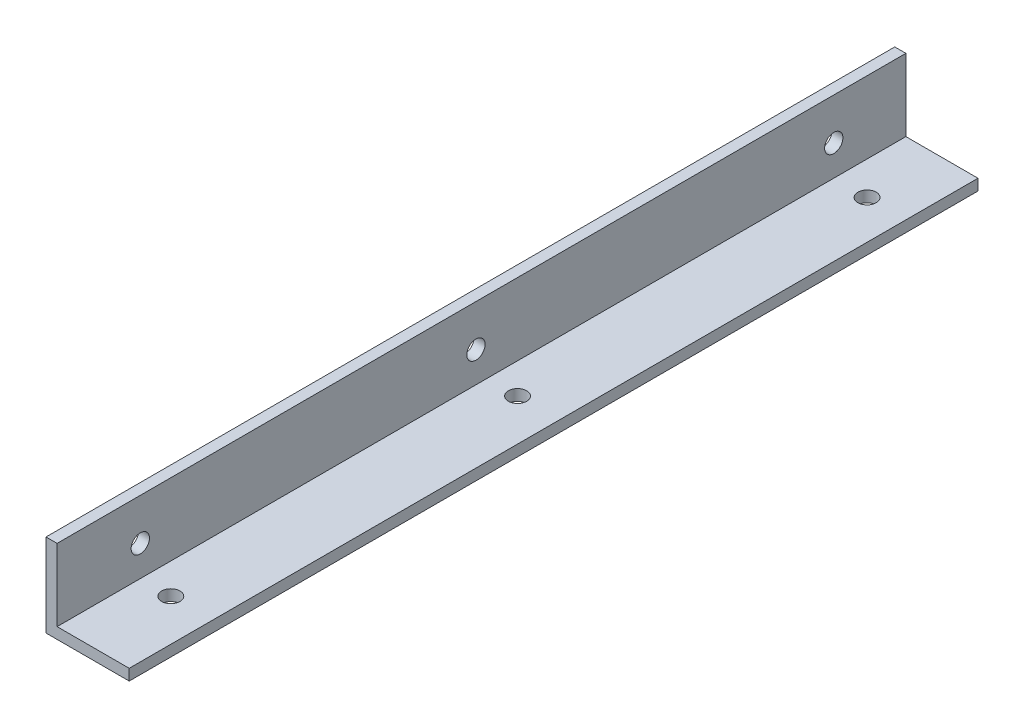
ISO-10303-21;
HEADER;
FILE_DESCRIPTION(('STEP AP214'),'2;1');
FILE_NAME('part.step','',(''),(''),'','','');
FILE_SCHEMA(('AUTOMOTIVE_DESIGN { 1 0 10303 214 1 1 1 1 }'));
ENDSEC;
DATA;
#1=APPLICATION_CONTEXT('core data for automotive mechanical design processes');
#2=APPLICATION_PROTOCOL_DEFINITION('international standard','automotive_design',2000,#1);
#3=PRODUCT_CONTEXT('',#1,'mechanical');
#4=PRODUCT('Part','Part','',(#3));
#5=PRODUCT_RELATED_PRODUCT_CATEGORY('part','',(#4));
#6=PRODUCT_DEFINITION_FORMATION('','',#4);
#7=PRODUCT_DEFINITION_CONTEXT('part definition',#1,'design');
#8=PRODUCT_DEFINITION('design','',#6,#7);
#9=PRODUCT_DEFINITION_SHAPE('','',#8);
#10=(LENGTH_UNIT() NAMED_UNIT(*) SI_UNIT(.MILLI.,.METRE.));
#11=(NAMED_UNIT(*) PLANE_ANGLE_UNIT() SI_UNIT($,.RADIAN.));
#12=(NAMED_UNIT(*) SI_UNIT($,.STERADIAN.) SOLID_ANGLE_UNIT());
#13=UNCERTAINTY_MEASURE_WITH_UNIT(LENGTH_MEASURE(1.E-05),#10,'distance_accuracy_value','');
#14=(GEOMETRIC_REPRESENTATION_CONTEXT(3) GLOBAL_UNCERTAINTY_ASSIGNED_CONTEXT((#13)) GLOBAL_UNIT_ASSIGNED_CONTEXT((#10,
#11,#12)) REPRESENTATION_CONTEXT('',''));
#15=CARTESIAN_POINT('',(0.,0.,0.));
#16=DIRECTION('',(0.,0.,1.));
#17=DIRECTION('',(1.,0.,0.));
#18=AXIS2_PLACEMENT_3D('',#15,#16,#17);
#19=CARTESIAN_POINT('',(15.,0.,155.));
#20=DIRECTION('',(0.,1.,0.));
#21=DIRECTION('',(-1.,0.,0.));
#22=AXIS2_PLACEMENT_3D('',#19,#20,#21);
#23=PLANE('',#22);
#24=CARTESIAN_POINT('',(7.5,0.,140.));
#25=DIRECTION('',(0.,1.,0.));
#26=DIRECTION('',(-1.,0.,0.));
#27=AXIS2_PLACEMENT_3D('',#24,#25,#26);
#28=CIRCLE('',#27,1.64999999999999);
#29=CARTESIAN_POINT('',(5.85000000000001,0.,140.));
#30=VERTEX_POINT('',#29);
#31=EDGE_CURVE('E138',#30,#30,#28,.T.);
#32=ORIENTED_EDGE('',*,*,#31,.T.);
#33=EDGE_LOOP('',(#32));
#34=FACE_BOUND('',#33,.T.);
#35=CARTESIAN_POINT('',(7.5,0.,77.5));
#36=DIRECTION('',(0.,1.,0.));
#37=DIRECTION('',(-1.,0.,0.));
#38=AXIS2_PLACEMENT_3D('',#35,#36,#37);
#39=CIRCLE('',#38,1.64999999999999);
#40=CARTESIAN_POINT('',(5.85000000000001,0.,77.5));
#41=VERTEX_POINT('',#40);
#42=EDGE_CURVE('E144',#41,#41,#39,.T.);
#43=ORIENTED_EDGE('',*,*,#42,.T.);
#44=EDGE_LOOP('',(#43));
#45=FACE_BOUND('',#44,.T.);
#46=CARTESIAN_POINT('',(8.,0.,15.));
#47=DIRECTION('',(0.,1.,0.));
#48=DIRECTION('',(-1.,0.,0.));
#49=AXIS2_PLACEMENT_3D('',#46,#47,#48);
#50=CIRCLE('',#49,1.64999999999999);
#51=CARTESIAN_POINT('',(6.35000000000001,0.,15.));
#52=VERTEX_POINT('',#51);
#53=EDGE_CURVE('E156',#52,#52,#50,.T.);
#54=ORIENTED_EDGE('',*,*,#53,.T.);
#55=EDGE_LOOP('',(#54));
#56=FACE_BOUND('',#55,.T.);
#57=DIRECTION('',(0.,0.,-1.));
#58=VECTOR('',#57,1.);
#59=CARTESIAN_POINT('',(0.,0.,155.));
#60=LINE('',#59,#58);
#61=CARTESIAN_POINT('',(0.,0.,155.));
#62=VERTEX_POINT('',#61);
#63=CARTESIAN_POINT('',(0.,0.,2.));
#64=VERTEX_POINT('',#63);
#65=EDGE_CURVE('E102',#62,#64,#60,.T.);
#66=ORIENTED_EDGE('',*,*,#65,.T.);
#67=DIRECTION('',(1.,0.,0.));
#68=VECTOR('',#67,1.);
#69=CARTESIAN_POINT('',(15.,0.,2.));
#70=LINE('',#69,#68);
#71=CARTESIAN_POINT('',(15.,0.,2.));
#72=VERTEX_POINT('',#71);
#73=EDGE_CURVE('E49',#64,#72,#70,.T.);
#74=ORIENTED_EDGE('',*,*,#73,.T.);
#75=DIRECTION('',(0.,0.,-1.));
#76=VECTOR('',#75,1.);
#77=CARTESIAN_POINT('',(15.,0.,155.));
#78=LINE('',#77,#76);
#79=CARTESIAN_POINT('',(15.,0.,155.));
#80=VERTEX_POINT('',#79);
#81=EDGE_CURVE('E42',#80,#72,#78,.T.);
#82=ORIENTED_EDGE('',*,*,#81,.F.);
#83=DIRECTION('',(1.,0.,0.));
#84=VECTOR('',#83,1.);
#85=CARTESIAN_POINT('',(15.,0.,155.));
#86=LINE('',#85,#84);
#87=EDGE_CURVE('E123',#62,#80,#86,.T.);
#88=ORIENTED_EDGE('',*,*,#87,.F.);
#89=EDGE_LOOP('',(#66,#74,#82,#88));
#90=FACE_BOUND('',#89,.T.);
#91=ADVANCED_FACE('F35',(#34,#45,#56,#90),#23,.F.);
#92=CARTESIAN_POINT('',(15.,2.,155.));
#93=DIRECTION('',(-1.,0.,0.));
#94=DIRECTION('',(0.,0.,1.));
#95=AXIS2_PLACEMENT_3D('',#92,#93,#94);
#96=PLANE('',#95);
#97=ORIENTED_EDGE('',*,*,#81,.T.);
#98=DIRECTION('',(0.,1.,0.));
#99=VECTOR('',#98,1.);
#100=CARTESIAN_POINT('',(15.,2.,2.));
#101=LINE('',#100,#99);
#102=CARTESIAN_POINT('',(15.,2.,2.));
#103=VERTEX_POINT('',#102);
#104=EDGE_CURVE('E119',#72,#103,#101,.T.);
#105=ORIENTED_EDGE('',*,*,#104,.T.);
#106=DIRECTION('',(0.,0.,-1.));
#107=VECTOR('',#106,1.);
#108=CARTESIAN_POINT('',(15.,2.,155.));
#109=LINE('',#108,#107);
#110=CARTESIAN_POINT('',(15.,2.,155.));
#111=VERTEX_POINT('',#110);
#112=EDGE_CURVE('E111',#111,#103,#109,.T.);
#113=ORIENTED_EDGE('',*,*,#112,.F.);
#114=DIRECTION('',(0.,1.,0.));
#115=VECTOR('',#114,1.);
#116=CARTESIAN_POINT('',(15.,2.,155.));
#117=LINE('',#116,#115);
#118=EDGE_CURVE('E120',#80,#111,#117,.T.);
#119=ORIENTED_EDGE('',*,*,#118,.F.);
#120=EDGE_LOOP('',(#97,#105,#113,#119));
#121=FACE_BOUND('',#120,.T.);
#122=ADVANCED_FACE('F117',(#121),#96,.F.);
#123=CARTESIAN_POINT('',(2.,2.,155.));
#124=DIRECTION('',(0.,-1.,0.));
#125=DIRECTION('',(0.,0.,-1.));
#126=AXIS2_PLACEMENT_3D('',#123,#124,#125);
#127=PLANE('',#126);
#128=CARTESIAN_POINT('',(7.5,2.,140.));
#129=DIRECTION('',(0.,1.,0.));
#130=DIRECTION('',(0.,0.,1.));
#131=AXIS2_PLACEMENT_3D('',#128,#129,#130);
#132=CIRCLE('',#131,1.64999999999999);
#133=CARTESIAN_POINT('',(7.5,2.,141.65));
#134=VERTEX_POINT('',#133);
#135=EDGE_CURVE('E135',#134,#134,#132,.T.);
#136=ORIENTED_EDGE('',*,*,#135,.F.);
#137=EDGE_LOOP('',(#136));
#138=FACE_BOUND('',#137,.T.);
#139=CARTESIAN_POINT('',(7.5,2.,77.5));
#140=DIRECTION('',(0.,1.,0.));
#141=DIRECTION('',(0.,0.,1.));
#142=AXIS2_PLACEMENT_3D('',#139,#140,#141);
#143=CIRCLE('',#142,1.64999999999999);
#144=CARTESIAN_POINT('',(7.5,2.,79.15));
#145=VERTEX_POINT('',#144);
#146=EDGE_CURVE('E141',#145,#145,#143,.T.);
#147=ORIENTED_EDGE('',*,*,#146,.F.);
#148=EDGE_LOOP('',(#147));
#149=FACE_BOUND('',#148,.T.);
#150=CARTESIAN_POINT('',(8.,2.,15.));
#151=DIRECTION('',(0.,1.,0.));
#152=DIRECTION('',(0.,0.,1.));
#153=AXIS2_PLACEMENT_3D('',#150,#151,#152);
#154=CIRCLE('',#153,1.64999999999999);
#155=CARTESIAN_POINT('',(8.,2.,16.65));
#156=VERTEX_POINT('',#155);
#157=EDGE_CURVE('E153',#156,#156,#154,.T.);
#158=ORIENTED_EDGE('',*,*,#157,.F.);
#159=EDGE_LOOP('',(#158));
#160=FACE_BOUND('',#159,.T.);
#161=ORIENTED_EDGE('',*,*,#112,.T.);
#162=DIRECTION('',(-1.,0.,0.));
#163=VECTOR('',#162,1.);
#164=CARTESIAN_POINT('',(2.,2.,2.));
#165=LINE('',#164,#163);
#166=CARTESIAN_POINT('',(2.,2.,2.));
#167=VERTEX_POINT('',#166);
#168=EDGE_CURVE('E129',#103,#167,#165,.T.);
#169=ORIENTED_EDGE('',*,*,#168,.T.);
#170=DIRECTION('',(0.,0.,-1.));
#171=VECTOR('',#170,1.);
#172=CARTESIAN_POINT('',(2.,2.,155.));
#173=LINE('',#172,#171);
#174=CARTESIAN_POINT('',(2.,2.,155.));
#175=VERTEX_POINT('',#174);
#176=EDGE_CURVE('E104',#175,#167,#173,.T.);
#177=ORIENTED_EDGE('',*,*,#176,.F.);
#178=DIRECTION('',(-1.,0.,0.));
#179=VECTOR('',#178,1.);
#180=CARTESIAN_POINT('',(2.,2.,155.));
#181=LINE('',#180,#179);
#182=EDGE_CURVE('E167',#111,#175,#181,.T.);
#183=ORIENTED_EDGE('',*,*,#182,.F.);
#184=EDGE_LOOP('',(#161,#169,#177,#183));
#185=FACE_BOUND('',#184,.T.);
#186=ADVANCED_FACE('F181',(#138,#149,#160,#185),#127,.F.);
#187=CARTESIAN_POINT('',(2.,15.,155.));
#188=DIRECTION('',(-1.,0.,0.));
#189=DIRECTION('',(0.,-1.,0.));
#190=AXIS2_PLACEMENT_3D('',#187,#188,#189);
#191=PLANE('',#190);
#192=CARTESIAN_POINT('',(2.,7.49999999999998,140.));
#193=DIRECTION('',(1.,0.,0.));
#194=DIRECTION('',(0.,0.,-1.));
#195=AXIS2_PLACEMENT_3D('',#192,#193,#194);
#196=CIRCLE('',#195,1.64999999999999);
#197=CARTESIAN_POINT('',(2.,7.49999999999998,138.35));
#198=VERTEX_POINT('',#197);
#199=EDGE_CURVE('E124',#198,#198,#196,.T.);
#200=ORIENTED_EDGE('',*,*,#199,.F.);
#201=EDGE_LOOP('',(#200));
#202=FACE_BOUND('',#201,.T.);
#203=CARTESIAN_POINT('',(2.,7.49999999999998,79.5));
#204=DIRECTION('',(1.,0.,0.));
#205=DIRECTION('',(0.,0.,-1.));
#206=AXIS2_PLACEMENT_3D('',#203,#204,#205);
#207=CIRCLE('',#206,1.64999999999999);
#208=CARTESIAN_POINT('',(2.,7.49999999999998,77.85));
#209=VERTEX_POINT('',#208);
#210=EDGE_CURVE('E147',#209,#209,#207,.T.);
#211=ORIENTED_EDGE('',*,*,#210,.F.);
#212=EDGE_LOOP('',(#211));
#213=FACE_BOUND('',#212,.T.);
#214=CARTESIAN_POINT('',(2.,7.5,15.));
#215=DIRECTION('',(1.,0.,0.));
#216=DIRECTION('',(0.,0.,-1.));
#217=AXIS2_PLACEMENT_3D('',#214,#215,#216);
#218=CIRCLE('',#217,1.64999999999999);
#219=CARTESIAN_POINT('',(2.,7.5,13.35));
#220=VERTEX_POINT('',#219);
#221=EDGE_CURVE('E159',#220,#220,#218,.T.);
#222=ORIENTED_EDGE('',*,*,#221,.F.);
#223=EDGE_LOOP('',(#222));
#224=FACE_BOUND('',#223,.T.);
#225=ORIENTED_EDGE('',*,*,#176,.T.);
#226=DIRECTION('',(0.,1.,0.));
#227=VECTOR('',#226,1.);
#228=CARTESIAN_POINT('',(2.,15.,2.));
#229=LINE('',#228,#227);
#230=CARTESIAN_POINT('',(2.,15.,2.));
#231=VERTEX_POINT('',#230);
#232=EDGE_CURVE('E99',#167,#231,#229,.T.);
#233=ORIENTED_EDGE('',*,*,#232,.T.);
#234=DIRECTION('',(0.,0.,-1.));
#235=VECTOR('',#234,1.);
#236=CARTESIAN_POINT('',(2.,15.,155.));
#237=LINE('',#236,#235);
#238=CARTESIAN_POINT('',(2.,15.,155.));
#239=VERTEX_POINT('',#238);
#240=EDGE_CURVE('E98',#239,#231,#237,.T.);
#241=ORIENTED_EDGE('',*,*,#240,.F.);
#242=DIRECTION('',(0.,1.,0.));
#243=VECTOR('',#242,1.);
#244=CARTESIAN_POINT('',(2.,15.,155.));
#245=LINE('',#244,#243);
#246=EDGE_CURVE('E169',#175,#239,#245,.T.);
#247=ORIENTED_EDGE('',*,*,#246,.F.);
#248=EDGE_LOOP('',(#225,#233,#241,#247));
#249=FACE_BOUND('',#248,.T.);
#250=ADVANCED_FACE('F177',(#202,#213,#224,#249),#191,.F.);
#251=CARTESIAN_POINT('',(0.,15.,155.));
#252=DIRECTION('',(0.,-1.,0.));
#253=DIRECTION('',(0.,0.,-1.));
#254=AXIS2_PLACEMENT_3D('',#251,#252,#253);
#255=PLANE('',#254);
#256=ORIENTED_EDGE('',*,*,#240,.T.);
#257=DIRECTION('',(-1.,0.,0.));
#258=VECTOR('',#257,1.);
#259=CARTESIAN_POINT('',(0.,15.,2.));
#260=LINE('',#259,#258);
#261=CARTESIAN_POINT('',(0.,15.,2.));
#262=VERTEX_POINT('',#261);
#263=EDGE_CURVE('E86',#231,#262,#260,.T.);
#264=ORIENTED_EDGE('',*,*,#263,.T.);
#265=DIRECTION('',(0.,0.,-1.));
#266=VECTOR('',#265,1.);
#267=CARTESIAN_POINT('',(0.,15.,155.));
#268=LINE('',#267,#266);
#269=CARTESIAN_POINT('',(0.,15.,155.));
#270=VERTEX_POINT('',#269);
#271=EDGE_CURVE('E96',#270,#262,#268,.T.);
#272=ORIENTED_EDGE('',*,*,#271,.F.);
#273=DIRECTION('',(-1.,0.,0.));
#274=VECTOR('',#273,1.);
#275=CARTESIAN_POINT('',(0.,15.,155.));
#276=LINE('',#275,#274);
#277=EDGE_CURVE('E171',#239,#270,#276,.T.);
#278=ORIENTED_EDGE('',*,*,#277,.F.);
#279=EDGE_LOOP('',(#256,#264,#272,#278));
#280=FACE_BOUND('',#279,.T.);
#281=ADVANCED_FACE('F94',(#280),#255,.F.);
#282=CARTESIAN_POINT('',(0.,0.,155.));
#283=DIRECTION('',(1.,0.,0.));
#284=DIRECTION('',(0.,0.,-1.));
#285=AXIS2_PLACEMENT_3D('',#282,#283,#284);
#286=PLANE('',#285);
#287=CARTESIAN_POINT('',(0.,7.49999999999998,140.));
#288=DIRECTION('',(1.,0.,0.));
#289=DIRECTION('',(0.,0.,-1.));
#290=AXIS2_PLACEMENT_3D('',#287,#288,#289);
#291=CIRCLE('',#290,1.64999999999999);
#292=CARTESIAN_POINT('',(0.,7.49999999999998,138.35));
#293=VERTEX_POINT('',#292);
#294=EDGE_CURVE('E127',#293,#293,#291,.T.);
#295=ORIENTED_EDGE('',*,*,#294,.T.);
#296=EDGE_LOOP('',(#295));
#297=FACE_BOUND('',#296,.T.);
#298=CARTESIAN_POINT('',(0.,7.49999999999998,79.5));
#299=DIRECTION('',(1.,0.,0.));
#300=DIRECTION('',(0.,0.,-1.));
#301=AXIS2_PLACEMENT_3D('',#298,#299,#300);
#302=CIRCLE('',#301,1.64999999999999);
#303=CARTESIAN_POINT('',(0.,7.49999999999998,77.85));
#304=VERTEX_POINT('',#303);
#305=EDGE_CURVE('E150',#304,#304,#302,.T.);
#306=ORIENTED_EDGE('',*,*,#305,.T.);
#307=EDGE_LOOP('',(#306));
#308=FACE_BOUND('',#307,.T.);
#309=CARTESIAN_POINT('',(0.,7.5,15.));
#310=DIRECTION('',(1.,0.,0.));
#311=DIRECTION('',(0.,0.,-1.));
#312=AXIS2_PLACEMENT_3D('',#309,#310,#311);
#313=CIRCLE('',#312,1.64999999999999);
#314=CARTESIAN_POINT('',(0.,7.5,13.35));
#315=VERTEX_POINT('',#314);
#316=EDGE_CURVE('E162',#315,#315,#313,.T.);
#317=ORIENTED_EDGE('',*,*,#316,.T.);
#318=EDGE_LOOP('',(#317));
#319=FACE_BOUND('',#318,.T.);
#320=ORIENTED_EDGE('',*,*,#271,.T.);
#321=DIRECTION('',(0.,-1.,0.));
#322=VECTOR('',#321,1.);
#323=CARTESIAN_POINT('',(0.,0.,2.));
#324=LINE('',#323,#322);
#325=EDGE_CURVE('E11',#262,#64,#324,.T.);
#326=ORIENTED_EDGE('',*,*,#325,.T.);
#327=ORIENTED_EDGE('',*,*,#65,.F.);
#328=DIRECTION('',(0.,-1.,0.));
#329=VECTOR('',#328,1.);
#330=CARTESIAN_POINT('',(0.,0.,155.));
#331=LINE('',#330,#329);
#332=EDGE_CURVE('E56',#270,#62,#331,.T.);
#333=ORIENTED_EDGE('',*,*,#332,.F.);
#334=EDGE_LOOP('',(#320,#326,#327,#333));
#335=FACE_BOUND('',#334,.T.);
#336=ADVANCED_FACE('F101',(#297,#308,#319,#335),#286,.F.);
#337=CARTESIAN_POINT('',(0.,0.,155.));
#338=DIRECTION('',(0.,0.,-1.));
#339=DIRECTION('',(-1.,0.,0.));
#340=AXIS2_PLACEMENT_3D('',#337,#338,#339);
#341=PLANE('',#340);
#342=ORIENTED_EDGE('',*,*,#87,.T.);
#343=ORIENTED_EDGE('',*,*,#118,.T.);
#344=ORIENTED_EDGE('',*,*,#182,.T.);
#345=ORIENTED_EDGE('',*,*,#246,.T.);
#346=ORIENTED_EDGE('',*,*,#277,.T.);
#347=ORIENTED_EDGE('',*,*,#332,.T.);
#348=EDGE_LOOP('',(#342,#343,#344,#345,#346,#347));
#349=FACE_BOUND('',#348,.T.);
#350=ADVANCED_FACE('F172',(#349),#341,.F.);
#351=CARTESIAN_POINT('',(2.,7.5,15.));
#352=DIRECTION('',(1.,0.,0.));
#353=DIRECTION('',(0.,0.,-1.));
#354=AXIS2_PLACEMENT_3D('',#351,#352,#353);
#355=CYLINDRICAL_SURFACE('',#354,1.64999999999999);
#356=ORIENTED_EDGE('',*,*,#221,.T.);
#357=EDGE_LOOP('',(#356));
#358=FACE_BOUND('',#357,.T.);
#359=ORIENTED_EDGE('',*,*,#316,.F.);
#360=EDGE_LOOP('',(#359));
#361=FACE_BOUND('',#360,.T.);
#362=ADVANCED_FACE('F206',(#358,#361),#355,.F.);
#363=CARTESIAN_POINT('',(8.,2.,15.));
#364=DIRECTION('',(0.,1.,0.));
#365=DIRECTION('',(0.,0.,1.));
#366=AXIS2_PLACEMENT_3D('',#363,#364,#365);
#367=CYLINDRICAL_SURFACE('',#366,1.64999999999999);
#368=ORIENTED_EDGE('',*,*,#157,.T.);
#369=EDGE_LOOP('',(#368));
#370=FACE_BOUND('',#369,.T.);
#371=ORIENTED_EDGE('',*,*,#53,.F.);
#372=EDGE_LOOP('',(#371));
#373=FACE_BOUND('',#372,.T.);
#374=ADVANCED_FACE('F203',(#370,#373),#367,.F.);
#375=CARTESIAN_POINT('',(2.,7.49999999999998,79.5));
#376=DIRECTION('',(1.,0.,0.));
#377=DIRECTION('',(0.,0.,-1.));
#378=AXIS2_PLACEMENT_3D('',#375,#376,#377);
#379=CYLINDRICAL_SURFACE('',#378,1.64999999999999);
#380=ORIENTED_EDGE('',*,*,#210,.T.);
#381=EDGE_LOOP('',(#380));
#382=FACE_BOUND('',#381,.T.);
#383=ORIENTED_EDGE('',*,*,#305,.F.);
#384=EDGE_LOOP('',(#383));
#385=FACE_BOUND('',#384,.T.);
#386=ADVANCED_FACE('F205',(#382,#385),#379,.F.);
#387=CARTESIAN_POINT('',(7.5,2.,77.5));
#388=DIRECTION('',(0.,1.,0.));
#389=DIRECTION('',(0.,0.,1.));
#390=AXIS2_PLACEMENT_3D('',#387,#388,#389);
#391=CYLINDRICAL_SURFACE('',#390,1.64999999999999);
#392=ORIENTED_EDGE('',*,*,#146,.T.);
#393=EDGE_LOOP('',(#392));
#394=FACE_BOUND('',#393,.T.);
#395=ORIENTED_EDGE('',*,*,#42,.F.);
#396=EDGE_LOOP('',(#395));
#397=FACE_BOUND('',#396,.T.);
#398=ADVANCED_FACE('F213',(#394,#397),#391,.F.);
#399=CARTESIAN_POINT('',(7.5,2.,140.));
#400=DIRECTION('',(0.,1.,0.));
#401=DIRECTION('',(0.,0.,1.));
#402=AXIS2_PLACEMENT_3D('',#399,#400,#401);
#403=CYLINDRICAL_SURFACE('',#402,1.64999999999999);
#404=ORIENTED_EDGE('',*,*,#135,.T.);
#405=EDGE_LOOP('',(#404));
#406=FACE_BOUND('',#405,.T.);
#407=ORIENTED_EDGE('',*,*,#31,.F.);
#408=EDGE_LOOP('',(#407));
#409=FACE_BOUND('',#408,.T.);
#410=ADVANCED_FACE('F262',(#406,#409),#403,.F.);
#411=CARTESIAN_POINT('',(2.,7.49999999999998,140.));
#412=DIRECTION('',(1.,0.,0.));
#413=DIRECTION('',(0.,0.,-1.));
#414=AXIS2_PLACEMENT_3D('',#411,#412,#413);
#415=CYLINDRICAL_SURFACE('',#414,1.64999999999999);
#416=ORIENTED_EDGE('',*,*,#199,.T.);
#417=EDGE_LOOP('',(#416));
#418=FACE_BOUND('',#417,.T.);
#419=ORIENTED_EDGE('',*,*,#294,.F.);
#420=EDGE_LOOP('',(#419));
#421=FACE_BOUND('',#420,.T.);
#422=ADVANCED_FACE('F271',(#418,#421),#415,.F.);
#423=CARTESIAN_POINT('',(0.,0.,2.));
#424=DIRECTION('',(0.,0.,1.));
#425=DIRECTION('',(1.,0.,0.));
#426=AXIS2_PLACEMENT_3D('',#423,#424,#425);
#427=PLANE('',#426);
#428=ORIENTED_EDGE('',*,*,#325,.F.);
#429=ORIENTED_EDGE('',*,*,#263,.F.);
#430=ORIENTED_EDGE('',*,*,#232,.F.);
#431=ORIENTED_EDGE('',*,*,#168,.F.);
#432=ORIENTED_EDGE('',*,*,#104,.F.);
#433=ORIENTED_EDGE('',*,*,#73,.F.);
#434=EDGE_LOOP('',(#428,#429,#430,#431,#432,#433));
#435=FACE_BOUND('',#434,.T.);
#436=ADVANCED_FACE('F85',(#435),#427,.F.);
#437=CLOSED_SHELL('',(#91,#122,#186,#250,#281,#336,#350,#362,#374,#386,#398,#410,#422,#436));
#438=MANIFOLD_SOLID_BREP('B2',#437);
#439=ADVANCED_BREP_SHAPE_REPRESENTATION('',(#18,#438),#14);
#440=SHAPE_DEFINITION_REPRESENTATION(#9,#439);
ENDSEC;
END-ISO-10303-21;
